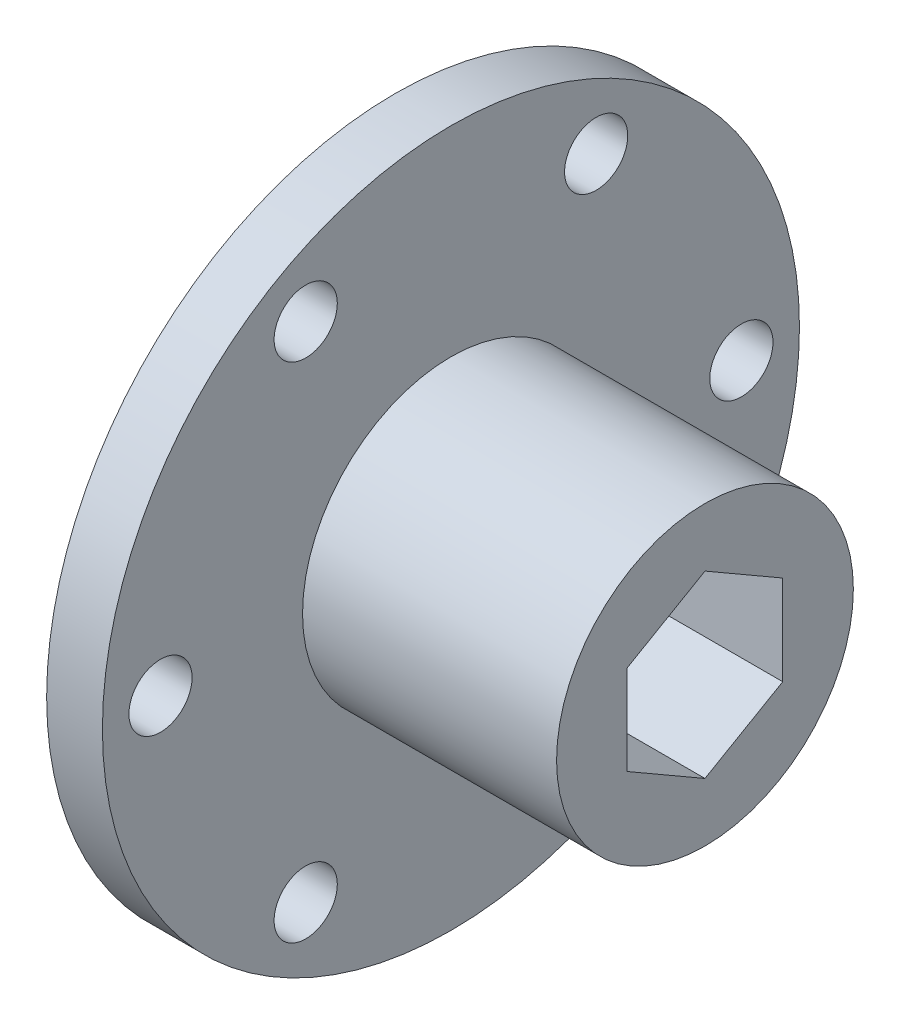
ISO-10303-21;
HEADER;
FILE_DESCRIPTION(('STEP AP214'),'2;1');
FILE_NAME('part.step','',(''),(''),'','','');
FILE_SCHEMA(('AUTOMOTIVE_DESIGN { 1 0 10303 214 1 1 1 1 }'));
ENDSEC;
DATA;
#1=APPLICATION_CONTEXT('core data for automotive mechanical design processes');
#2=APPLICATION_PROTOCOL_DEFINITION('international standard','automotive_design',2000,#1);
#3=PRODUCT_CONTEXT('',#1,'mechanical');
#4=PRODUCT('Part','Part','',(#3));
#5=PRODUCT_RELATED_PRODUCT_CATEGORY('part','',(#4));
#6=PRODUCT_DEFINITION_FORMATION('','',#4);
#7=PRODUCT_DEFINITION_CONTEXT('part definition',#1,'design');
#8=PRODUCT_DEFINITION('design','',#6,#7);
#9=PRODUCT_DEFINITION_SHAPE('','',#8);
#10=(LENGTH_UNIT() NAMED_UNIT(*) SI_UNIT(.MILLI.,.METRE.));
#11=(NAMED_UNIT(*) PLANE_ANGLE_UNIT() SI_UNIT($,.RADIAN.));
#12=(NAMED_UNIT(*) SI_UNIT($,.STERADIAN.) SOLID_ANGLE_UNIT());
#13=UNCERTAINTY_MEASURE_WITH_UNIT(LENGTH_MEASURE(1.E-05),#10,'distance_accuracy_value','');
#14=(GEOMETRIC_REPRESENTATION_CONTEXT(3) GLOBAL_UNCERTAINTY_ASSIGNED_CONTEXT((#13)) GLOBAL_UNIT_ASSIGNED_CONTEXT((#10,
#11,#12)) REPRESENTATION_CONTEXT('',''));
#15=CARTESIAN_POINT('',(0.,0.,0.));
#16=DIRECTION('',(0.,0.,1.));
#17=DIRECTION('',(1.,0.,0.));
#18=AXIS2_PLACEMENT_3D('',#15,#16,#17);
#19=CARTESIAN_POINT('',(-17.6070662460568,0.,0.));
#20=DIRECTION('',(-1.,0.,0.));
#21=DIRECTION('',(0.,0.,1.));
#22=AXIS2_PLACEMENT_3D('',#19,#20,#21);
#23=PLANE('',#22);
#24=CARTESIAN_POINT('',(-17.6070662460568,-20.6222299276169,-11.90625));
#25=DIRECTION('',(1.,0.,0.));
#26=DIRECTION('',(0.,0.,-1.));
#27=AXIS2_PLACEMENT_3D('',#24,#25,#26);
#28=CIRCLE('',#27,2.59080000000001);
#29=CARTESIAN_POINT('',(-17.6070662460568,-20.6222299276169,-14.49705));
#30=VERTEX_POINT('',#29);
#31=EDGE_CURVE('E228',#30,#30,#28,.T.);
#32=ORIENTED_EDGE('',*,*,#31,.T.);
#33=EDGE_LOOP('',(#32));
#34=FACE_BOUND('',#33,.T.);
#35=CARTESIAN_POINT('',(-17.6070662460567,0.,-23.8125));
#36=DIRECTION('',(1.,0.,0.));
#37=DIRECTION('',(0.,0.,-1.));
#38=AXIS2_PLACEMENT_3D('',#35,#36,#37);
#39=CIRCLE('',#38,2.59080000000001);
#40=CARTESIAN_POINT('',(-17.6070662460567,0.,-26.4033));
#41=VERTEX_POINT('',#40);
#42=EDGE_CURVE('E233',#41,#41,#39,.T.);
#43=ORIENTED_EDGE('',*,*,#42,.T.);
#44=EDGE_LOOP('',(#43));
#45=FACE_BOUND('',#44,.T.);
#46=CARTESIAN_POINT('',(-17.6070662460567,20.6222299276169,-11.90625));
#47=DIRECTION('',(1.,0.,0.));
#48=DIRECTION('',(0.,0.,-1.));
#49=AXIS2_PLACEMENT_3D('',#46,#47,#48);
#50=CIRCLE('',#49,2.59080000000001);
#51=CARTESIAN_POINT('',(-17.6070662460567,20.6222299276169,-14.49705));
#52=VERTEX_POINT('',#51);
#53=EDGE_CURVE('E239',#52,#52,#50,.T.);
#54=ORIENTED_EDGE('',*,*,#53,.T.);
#55=EDGE_LOOP('',(#54));
#56=FACE_BOUND('',#55,.T.);
#57=CARTESIAN_POINT('',(-17.6070662460567,20.6222299276169,11.90625));
#58=DIRECTION('',(1.,0.,0.));
#59=DIRECTION('',(0.,0.,-1.));
#60=AXIS2_PLACEMENT_3D('',#57,#58,#59);
#61=CIRCLE('',#60,2.59080000000001);
#62=CARTESIAN_POINT('',(-17.6070662460567,20.6222299276169,9.31544999999998));
#63=VERTEX_POINT('',#62);
#64=EDGE_CURVE('E245',#63,#63,#61,.T.);
#65=ORIENTED_EDGE('',*,*,#64,.T.);
#66=EDGE_LOOP('',(#65));
#67=FACE_BOUND('',#66,.T.);
#68=CARTESIAN_POINT('',(-17.6070662460568,0.,23.8125));
#69=DIRECTION('',(1.,0.,0.));
#70=DIRECTION('',(0.,0.,-1.));
#71=AXIS2_PLACEMENT_3D('',#68,#69,#70);
#72=CIRCLE('',#71,2.59080000000001);
#73=CARTESIAN_POINT('',(-17.6070662460568,0.,21.2217));
#74=VERTEX_POINT('',#73);
#75=EDGE_CURVE('E109',#74,#74,#72,.T.);
#76=ORIENTED_EDGE('',*,*,#75,.T.);
#77=EDGE_LOOP('',(#76));
#78=FACE_BOUND('',#77,.T.);
#79=DIRECTION('',(0.,-0.5,-0.866025403784437));
#80=VECTOR('',#79,1.);
#81=CARTESIAN_POINT('',(-17.6070662460568,-3.68085890619155,6.3754));
#82=LINE('',#81,#80);
#83=CARTESIAN_POINT('',(-17.6070662460568,-3.68085890619155,6.3754));
#84=VERTEX_POINT('',#83);
#85=CARTESIAN_POINT('',(-17.6070662460568,-7.36169781238311,0.));
#86=VERTEX_POINT('',#85);
#87=EDGE_CURVE('E87',#84,#86,#82,.T.);
#88=ORIENTED_EDGE('',*,*,#87,.T.);
#89=DIRECTION('',(0.,0.500000000000001,-0.866025403784438));
#90=VECTOR('',#89,1.);
#91=CARTESIAN_POINT('',(-17.6070662460568,-7.36169781238311,0.));
#92=LINE('',#91,#90);
#93=CARTESIAN_POINT('',(-17.6070662460568,-3.68085890619155,-6.37539999999998));
#94=VERTEX_POINT('',#93);
#95=EDGE_CURVE('E96',#86,#94,#92,.T.);
#96=ORIENTED_EDGE('',*,*,#95,.T.);
#97=DIRECTION('',(0.,0.999999999999999,0.));
#98=VECTOR('',#97,1.);
#99=CARTESIAN_POINT('',(-17.6070662460568,-3.68085890619155,-6.37539999999998));
#100=LINE('',#99,#98);
#101=CARTESIAN_POINT('',(-17.6070662460568,3.68081890619154,-6.3754));
#102=VERTEX_POINT('',#101);
#103=EDGE_CURVE('E47',#94,#102,#100,.T.);
#104=ORIENTED_EDGE('',*,*,#103,.T.);
#105=DIRECTION('',(0.,0.500000000000001,0.866025403784437));
#106=VECTOR('',#105,1.);
#107=CARTESIAN_POINT('',(-17.6070662460568,3.68081890619154,-6.3754));
#108=LINE('',#107,#106);
#109=CARTESIAN_POINT('',(-17.6070662460567,7.36165781238307,0.));
#110=VERTEX_POINT('',#109);
#111=EDGE_CURVE('E113',#102,#110,#108,.T.);
#112=ORIENTED_EDGE('',*,*,#111,.T.);
#113=DIRECTION('',(0.,-0.500000000000001,0.866025403784437));
#114=VECTOR('',#113,1.);
#115=CARTESIAN_POINT('',(-17.6070662460567,7.36165781238307,0.));
#116=LINE('',#115,#114);
#117=CARTESIAN_POINT('',(-17.6070662460568,3.68081890619157,6.37540000000003));
#118=VERTEX_POINT('',#117);
#119=EDGE_CURVE('E116',#110,#118,#116,.T.);
#120=ORIENTED_EDGE('',*,*,#119,.T.);
#121=DIRECTION('',(0.,-0.999999999999999,0.));
#122=VECTOR('',#121,1.);
#123=CARTESIAN_POINT('',(-17.6070662460568,3.68081890619157,6.37540000000003));
#124=LINE('',#123,#122);
#125=EDGE_CURVE('E93',#118,#84,#124,.T.);
#126=ORIENTED_EDGE('',*,*,#125,.T.);
#127=EDGE_LOOP('',(#88,#96,#104,#112,#120,#126));
#128=FACE_BOUND('',#127,.T.);
#129=CARTESIAN_POINT('',(-17.6070662460568,0.,0.));
#130=DIRECTION('',(-1.,0.,0.));
#131=DIRECTION('',(0.,0.,1.));
#132=AXIS2_PLACEMENT_3D('',#129,#130,#131);
#133=CIRCLE('',#132,28.575);
#134=CARTESIAN_POINT('',(-17.6070662460568,0.,28.575));
#135=VERTEX_POINT('',#134);
#136=EDGE_CURVE('E40',#135,#135,#133,.T.);
#137=ORIENTED_EDGE('',*,*,#136,.T.);
#138=EDGE_LOOP('',(#137));
#139=FACE_BOUND('',#138,.T.);
#140=CARTESIAN_POINT('',(-17.6070662460568,-20.622229927617,11.90625));
#141=DIRECTION('',(1.,0.,0.));
#142=DIRECTION('',(0.,0.,-1.));
#143=AXIS2_PLACEMENT_3D('',#140,#141,#142);
#144=CIRCLE('',#143,2.59080000000001);
#145=CARTESIAN_POINT('',(-17.6070662460568,-20.622229927617,9.31544999999998));
#146=VERTEX_POINT('',#145);
#147=EDGE_CURVE('E218',#146,#146,#144,.T.);
#148=ORIENTED_EDGE('',*,*,#147,.T.);
#149=EDGE_LOOP('',(#148));
#150=FACE_BOUND('',#149,.T.);
#151=ADVANCED_FACE('F32',(#34,#45,#56,#67,#78,#128,#139,#150),#23,.T.);
#152=CARTESIAN_POINT('',(-13.0350662460568,28.575,0.));
#153=DIRECTION('',(1.,0.,0.));
#154=DIRECTION('',(0.,0.,-1.));
#155=AXIS2_PLACEMENT_3D('',#152,#153,#154);
#156=PLANE('',#155);
#157=CARTESIAN_POINT('',(-13.0350662460568,-20.622229927617,11.90625));
#158=DIRECTION('',(1.,0.,0.));
#159=DIRECTION('',(0.,0.,-1.));
#160=AXIS2_PLACEMENT_3D('',#157,#158,#159);
#161=CIRCLE('',#160,2.59080000000001);
#162=CARTESIAN_POINT('',(-13.0350662460568,-20.622229927617,9.31544999999998));
#163=VERTEX_POINT('',#162);
#164=EDGE_CURVE('E221',#163,#163,#161,.T.);
#165=ORIENTED_EDGE('',*,*,#164,.F.);
#166=EDGE_LOOP('',(#165));
#167=FACE_BOUND('',#166,.T.);
#168=CARTESIAN_POINT('',(-13.0350662460568,-20.6222299276169,-11.9062500000001));
#169=DIRECTION('',(1.,0.,0.));
#170=DIRECTION('',(0.,0.,-1.));
#171=AXIS2_PLACEMENT_3D('',#168,#169,#170);
#172=CIRCLE('',#171,2.59080000000001);
#173=CARTESIAN_POINT('',(-13.0350662460568,-20.6222299276169,-14.4970500000001));
#174=VERTEX_POINT('',#173);
#175=EDGE_CURVE('E223',#174,#174,#172,.T.);
#176=ORIENTED_EDGE('',*,*,#175,.F.);
#177=EDGE_LOOP('',(#176));
#178=FACE_BOUND('',#177,.T.);
#179=CARTESIAN_POINT('',(-13.0350662460567,0.,-23.8125));
#180=DIRECTION('',(1.,0.,0.));
#181=DIRECTION('',(0.,0.,-1.));
#182=AXIS2_PLACEMENT_3D('',#179,#180,#181);
#183=CIRCLE('',#182,2.59080000000001);
#184=CARTESIAN_POINT('',(-13.0350662460567,0.,-26.4033));
#185=VERTEX_POINT('',#184);
#186=EDGE_CURVE('E230',#185,#185,#183,.T.);
#187=ORIENTED_EDGE('',*,*,#186,.F.);
#188=EDGE_LOOP('',(#187));
#189=FACE_BOUND('',#188,.T.);
#190=CARTESIAN_POINT('',(-13.0350662460568,20.6222299276169,-11.90625));
#191=DIRECTION('',(1.,0.,0.));
#192=DIRECTION('',(0.,0.,-1.));
#193=AXIS2_PLACEMENT_3D('',#190,#191,#192);
#194=CIRCLE('',#193,2.59080000000001);
#195=CARTESIAN_POINT('',(-13.0350662460568,20.6222299276169,-14.49705));
#196=VERTEX_POINT('',#195);
#197=EDGE_CURVE('E236',#196,#196,#194,.T.);
#198=ORIENTED_EDGE('',*,*,#197,.F.);
#199=EDGE_LOOP('',(#198));
#200=FACE_BOUND('',#199,.T.);
#201=CARTESIAN_POINT('',(-13.0350662460567,20.622229927617,11.90625));
#202=DIRECTION('',(1.,0.,0.));
#203=DIRECTION('',(0.,0.,-1.));
#204=AXIS2_PLACEMENT_3D('',#201,#202,#203);
#205=CIRCLE('',#204,2.59080000000001);
#206=CARTESIAN_POINT('',(-13.0350662460567,20.622229927617,9.31545000000001));
#207=VERTEX_POINT('',#206);
#208=EDGE_CURVE('E242',#207,#207,#205,.T.);
#209=ORIENTED_EDGE('',*,*,#208,.F.);
#210=EDGE_LOOP('',(#209));
#211=FACE_BOUND('',#210,.T.);
#212=CARTESIAN_POINT('',(-13.0350662460568,0.,23.8125));
#213=DIRECTION('',(1.,0.,0.));
#214=DIRECTION('',(0.,0.,-1.));
#215=AXIS2_PLACEMENT_3D('',#212,#213,#214);
#216=CIRCLE('',#215,2.59080000000001);
#217=CARTESIAN_POINT('',(-13.0350662460568,0.,21.2217));
#218=VERTEX_POINT('',#217);
#219=EDGE_CURVE('E247',#218,#218,#216,.T.);
#220=ORIENTED_EDGE('',*,*,#219,.F.);
#221=EDGE_LOOP('',(#220));
#222=FACE_BOUND('',#221,.T.);
#223=CARTESIAN_POINT('',(-13.0350662460568,0.,0.));
#224=DIRECTION('',(-1.,0.,0.));
#225=DIRECTION('',(0.,0.,1.));
#226=AXIS2_PLACEMENT_3D('',#223,#224,#225);
#227=CIRCLE('',#226,28.575);
#228=CARTESIAN_POINT('',(-13.0350662460568,0.,28.575));
#229=VERTEX_POINT('',#228);
#230=EDGE_CURVE('E11',#229,#229,#227,.T.);
#231=ORIENTED_EDGE('',*,*,#230,.F.);
#232=EDGE_LOOP('',(#231));
#233=FACE_BOUND('',#232,.T.);
#234=CARTESIAN_POINT('',(-13.0350662460568,0.,0.));
#235=DIRECTION('',(1.,0.,0.));
#236=DIRECTION('',(0.,0.,-1.));
#237=AXIS2_PLACEMENT_3D('',#234,#235,#236);
#238=CIRCLE('',#237,12.1666);
#239=CARTESIAN_POINT('',(-13.0350662460568,0.,-12.1666));
#240=VERTEX_POINT('',#239);
#241=EDGE_CURVE('E132',#240,#240,#238,.T.);
#242=ORIENTED_EDGE('',*,*,#241,.F.);
#243=EDGE_LOOP('',(#242));
#244=FACE_BOUND('',#243,.T.);
#245=ADVANCED_FACE('F150',(#167,#178,#189,#200,#211,#222,#233,#244),#156,.T.);
#246=CARTESIAN_POINT('',(-13.0350662460568,0.,0.));
#247=DIRECTION('',(-1.,0.,0.));
#248=DIRECTION('',(0.,0.,1.));
#249=AXIS2_PLACEMENT_3D('',#246,#247,#248);
#250=CYLINDRICAL_SURFACE('',#249,28.575);
#251=ORIENTED_EDGE('',*,*,#230,.T.);
#252=EDGE_LOOP('',(#251));
#253=FACE_BOUND('',#252,.T.);
#254=ORIENTED_EDGE('',*,*,#136,.F.);
#255=EDGE_LOOP('',(#254));
#256=FACE_BOUND('',#255,.T.);
#257=ADVANCED_FACE('F34',(#253,#256),#250,.T.);
#258=CARTESIAN_POINT('',(7.79293375394323,0.,0.));
#259=DIRECTION('',(-1.,0.,0.));
#260=DIRECTION('',(0.,0.,1.));
#261=AXIS2_PLACEMENT_3D('',#258,#259,#260);
#262=CYLINDRICAL_SURFACE('',#261,12.1666);
#263=CARTESIAN_POINT('',(7.79293375394323,0.,0.));
#264=DIRECTION('',(1.,0.,0.));
#265=DIRECTION('',(0.,0.,-1.));
#266=AXIS2_PLACEMENT_3D('',#263,#264,#265);
#267=CIRCLE('',#266,12.1666);
#268=CARTESIAN_POINT('',(7.79293375394323,0.,-12.1666));
#269=VERTEX_POINT('',#268);
#270=EDGE_CURVE('E140',#269,#269,#267,.T.);
#271=ORIENTED_EDGE('',*,*,#270,.F.);
#272=EDGE_LOOP('',(#271));
#273=FACE_BOUND('',#272,.T.);
#274=ORIENTED_EDGE('',*,*,#241,.T.);
#275=EDGE_LOOP('',(#274));
#276=FACE_BOUND('',#275,.T.);
#277=ADVANCED_FACE('F149',(#273,#276),#262,.T.);
#278=CARTESIAN_POINT('',(7.79293375394323,0.,0.));
#279=DIRECTION('',(1.,0.,0.));
#280=DIRECTION('',(0.,0.,-1.));
#281=AXIS2_PLACEMENT_3D('',#278,#279,#280);
#282=PLANE('',#281);
#283=DIRECTION('',(0.,-0.5,-0.866025403784437));
#284=VECTOR('',#283,1.);
#285=CARTESIAN_POINT('',(7.79293375394323,-3.68085890619144,6.37539999999999));
#286=LINE('',#285,#284);
#287=CARTESIAN_POINT('',(7.79293375394323,-3.68085890619144,6.37539999999999));
#288=VERTEX_POINT('',#287);
#289=CARTESIAN_POINT('',(7.79293375394324,-7.36169781238299,0.));
#290=VERTEX_POINT('',#289);
#291=EDGE_CURVE('E55',#288,#290,#286,.T.);
#292=ORIENTED_EDGE('',*,*,#291,.F.);
#293=DIRECTION('',(0.,-0.999999999999999,0.));
#294=VECTOR('',#293,1.);
#295=CARTESIAN_POINT('',(7.79293375394324,3.68081890619168,6.3754000000001));
#296=LINE('',#295,#294);
#297=CARTESIAN_POINT('',(7.79293375394324,3.68081890619168,6.3754000000001));
#298=VERTEX_POINT('',#297);
#299=EDGE_CURVE('E103',#298,#288,#296,.T.);
#300=ORIENTED_EDGE('',*,*,#299,.F.);
#301=DIRECTION('',(0.,-0.500000000000001,0.866025403784437));
#302=VECTOR('',#301,1.);
#303=CARTESIAN_POINT('',(7.7929337539433,7.3616578123831,0.));
#304=LINE('',#303,#302);
#305=CARTESIAN_POINT('',(7.7929337539433,7.3616578123831,0.));
#306=VERTEX_POINT('',#305);
#307=EDGE_CURVE('E106',#306,#298,#304,.T.);
#308=ORIENTED_EDGE('',*,*,#307,.F.);
#309=DIRECTION('',(0.,0.500000000000001,0.866025403784437));
#310=VECTOR('',#309,1.);
#311=CARTESIAN_POINT('',(7.79293375394323,3.68081890619157,-6.37539999999999));
#312=LINE('',#311,#310);
#313=CARTESIAN_POINT('',(7.79293375394323,3.68081890619157,-6.37539999999999));
#314=VERTEX_POINT('',#313);
#315=EDGE_CURVE('E125',#314,#306,#312,.T.);
#316=ORIENTED_EDGE('',*,*,#315,.F.);
#317=DIRECTION('',(0.,0.999999999999999,0.));
#318=VECTOR('',#317,1.);
#319=CARTESIAN_POINT('',(7.79293375394324,-3.68085890619155,-6.37539999999999));
#320=LINE('',#319,#318);
#321=CARTESIAN_POINT('',(7.79293375394324,-3.68085890619155,-6.37539999999999));
#322=VERTEX_POINT('',#321);
#323=EDGE_CURVE('E122',#322,#314,#320,.T.);
#324=ORIENTED_EDGE('',*,*,#323,.F.);
#325=DIRECTION('',(0.,0.500000000000001,-0.866025403784438));
#326=VECTOR('',#325,1.);
#327=CARTESIAN_POINT('',(7.79293375394324,-7.36169781238299,0.));
#328=LINE('',#327,#326);
#329=EDGE_CURVE('E120',#290,#322,#328,.T.);
#330=ORIENTED_EDGE('',*,*,#329,.F.);
#331=EDGE_LOOP('',(#292,#300,#308,#316,#324,#330));
#332=FACE_BOUND('',#331,.T.);
#333=ORIENTED_EDGE('',*,*,#270,.T.);
#334=EDGE_LOOP('',(#333));
#335=FACE_BOUND('',#334,.T.);
#336=ADVANCED_FACE('F156',(#332,#335),#282,.T.);
#337=CARTESIAN_POINT('',(-17.6070662460568,-3.68085890619155,6.3754));
#338=DIRECTION('',(0.,-0.866025403784437,0.5));
#339=DIRECTION('',(0.,-0.5,-0.866025403784437));
#340=AXIS2_PLACEMENT_3D('',#337,#338,#339);
#341=PLANE('',#340);
#342=ORIENTED_EDGE('',*,*,#291,.T.);
#343=DIRECTION('',(1.,0.,0.));
#344=VECTOR('',#343,1.);
#345=CARTESIAN_POINT('',(-17.6070662460568,-7.36169781238311,0.));
#346=LINE('',#345,#344);
#347=EDGE_CURVE('E83',#86,#290,#346,.T.);
#348=ORIENTED_EDGE('',*,*,#347,.F.);
#349=ORIENTED_EDGE('',*,*,#87,.F.);
#350=DIRECTION('',(1.,0.,0.));
#351=VECTOR('',#350,1.);
#352=CARTESIAN_POINT('',(-17.6070662460568,-3.68085890619155,6.3754));
#353=LINE('',#352,#351);
#354=EDGE_CURVE('E130',#84,#288,#353,.T.);
#355=ORIENTED_EDGE('',*,*,#354,.T.);
#356=EDGE_LOOP('',(#342,#348,#349,#355));
#357=FACE_BOUND('',#356,.T.);
#358=ADVANCED_FACE('F85',(#357),#341,.F.);
#359=CARTESIAN_POINT('',(-17.6070662460568,3.68081890619157,6.37540000000003));
#360=DIRECTION('',(0.,0.,0.999999999999999));
#361=DIRECTION('',(0.,-0.999999999999999,0.));
#362=AXIS2_PLACEMENT_3D('',#359,#360,#361);
#363=PLANE('',#362);
#364=ORIENTED_EDGE('',*,*,#299,.T.);
#365=ORIENTED_EDGE('',*,*,#354,.F.);
#366=ORIENTED_EDGE('',*,*,#125,.F.);
#367=DIRECTION('',(1.,0.,0.));
#368=VECTOR('',#367,1.);
#369=CARTESIAN_POINT('',(-17.6070662460568,3.68081890619157,6.37540000000003));
#370=LINE('',#369,#368);
#371=EDGE_CURVE('E133',#118,#298,#370,.T.);
#372=ORIENTED_EDGE('',*,*,#371,.T.);
#373=EDGE_LOOP('',(#364,#365,#366,#372));
#374=FACE_BOUND('',#373,.T.);
#375=ADVANCED_FACE('F173',(#374),#363,.F.);
#376=CARTESIAN_POINT('',(-17.6070662460567,7.36165781238307,0.));
#377=DIRECTION('',(0.,0.866025403784437,0.500000000000001));
#378=DIRECTION('',(0.,-0.500000000000001,0.866025403784437));
#379=AXIS2_PLACEMENT_3D('',#376,#377,#378);
#380=PLANE('',#379);
#381=ORIENTED_EDGE('',*,*,#307,.T.);
#382=ORIENTED_EDGE('',*,*,#371,.F.);
#383=ORIENTED_EDGE('',*,*,#119,.F.);
#384=DIRECTION('',(1.,0.,0.));
#385=VECTOR('',#384,1.);
#386=CARTESIAN_POINT('',(-17.6070662460567,7.36165781238307,0.));
#387=LINE('',#386,#385);
#388=EDGE_CURVE('E135',#110,#306,#387,.T.);
#389=ORIENTED_EDGE('',*,*,#388,.T.);
#390=EDGE_LOOP('',(#381,#382,#383,#389));
#391=FACE_BOUND('',#390,.T.);
#392=ADVANCED_FACE('F183',(#391),#380,.F.);
#393=CARTESIAN_POINT('',(-17.6070662460568,3.68081890619154,-6.3754));
#394=DIRECTION('',(0.,0.866025403784437,-0.500000000000001));
#395=DIRECTION('',(0.,0.500000000000001,0.866025403784437));
#396=AXIS2_PLACEMENT_3D('',#393,#394,#395);
#397=PLANE('',#396);
#398=ORIENTED_EDGE('',*,*,#315,.T.);
#399=ORIENTED_EDGE('',*,*,#388,.F.);
#400=ORIENTED_EDGE('',*,*,#111,.F.);
#401=DIRECTION('',(1.,0.,0.));
#402=VECTOR('',#401,1.);
#403=CARTESIAN_POINT('',(-17.6070662460568,3.68081890619154,-6.3754));
#404=LINE('',#403,#402);
#405=EDGE_CURVE('E137',#102,#314,#404,.T.);
#406=ORIENTED_EDGE('',*,*,#405,.T.);
#407=EDGE_LOOP('',(#398,#399,#400,#406));
#408=FACE_BOUND('',#407,.T.);
#409=ADVANCED_FACE('F180',(#408),#397,.F.);
#410=CARTESIAN_POINT('',(-17.6070662460568,-3.68085890619155,-6.37539999999998));
#411=DIRECTION('',(0.,0.,-0.999999999999999));
#412=DIRECTION('',(0.,0.999999999999999,0.));
#413=AXIS2_PLACEMENT_3D('',#410,#411,#412);
#414=PLANE('',#413);
#415=ORIENTED_EDGE('',*,*,#323,.T.);
#416=ORIENTED_EDGE('',*,*,#405,.F.);
#417=ORIENTED_EDGE('',*,*,#103,.F.);
#418=DIRECTION('',(1.,0.,0.));
#419=VECTOR('',#418,1.);
#420=CARTESIAN_POINT('',(-17.6070662460568,-3.68085890619155,-6.37539999999998));
#421=LINE('',#420,#419);
#422=EDGE_CURVE('E92',#94,#322,#421,.T.);
#423=ORIENTED_EDGE('',*,*,#422,.T.);
#424=EDGE_LOOP('',(#415,#416,#417,#423));
#425=FACE_BOUND('',#424,.T.);
#426=ADVANCED_FACE('F177',(#425),#414,.F.);
#427=CARTESIAN_POINT('',(-17.6070662460568,-7.36169781238311,0.));
#428=DIRECTION('',(0.,-0.866025403784438,-0.500000000000001));
#429=DIRECTION('',(0.,0.500000000000001,-0.866025403784438));
#430=AXIS2_PLACEMENT_3D('',#427,#428,#429);
#431=PLANE('',#430);
#432=ORIENTED_EDGE('',*,*,#329,.T.);
#433=ORIENTED_EDGE('',*,*,#422,.F.);
#434=ORIENTED_EDGE('',*,*,#95,.F.);
#435=ORIENTED_EDGE('',*,*,#347,.T.);
#436=EDGE_LOOP('',(#432,#433,#434,#435));
#437=FACE_BOUND('',#436,.T.);
#438=ADVANCED_FACE('F97',(#437),#431,.F.);
#439=CARTESIAN_POINT('',(-13.0350662460568,0.,23.8125));
#440=DIRECTION('',(1.,0.,0.));
#441=DIRECTION('',(0.,0.,-1.));
#442=AXIS2_PLACEMENT_3D('',#439,#440,#441);
#443=CYLINDRICAL_SURFACE('',#442,2.59080000000001);
#444=ORIENTED_EDGE('',*,*,#75,.F.);
#445=EDGE_LOOP('',(#444));
#446=FACE_BOUND('',#445,.T.);
#447=ORIENTED_EDGE('',*,*,#219,.T.);
#448=EDGE_LOOP('',(#447));
#449=FACE_BOUND('',#448,.T.);
#450=ADVANCED_FACE('F176',(#446,#449),#443,.F.);
#451=CARTESIAN_POINT('',(-13.0350662460567,20.622229927617,11.90625));
#452=DIRECTION('',(1.,0.,0.));
#453=DIRECTION('',(0.,0.,-1.));
#454=AXIS2_PLACEMENT_3D('',#451,#452,#453);
#455=CYLINDRICAL_SURFACE('',#454,2.59080000000001);
#456=ORIENTED_EDGE('',*,*,#64,.F.);
#457=EDGE_LOOP('',(#456));
#458=FACE_BOUND('',#457,.T.);
#459=ORIENTED_EDGE('',*,*,#208,.T.);
#460=EDGE_LOOP('',(#459));
#461=FACE_BOUND('',#460,.T.);
#462=ADVANCED_FACE('F193',(#458,#461),#455,.F.);
#463=CARTESIAN_POINT('',(-13.0350662460568,20.6222299276169,-11.90625));
#464=DIRECTION('',(1.,0.,0.));
#465=DIRECTION('',(0.,0.,-1.));
#466=AXIS2_PLACEMENT_3D('',#463,#464,#465);
#467=CYLINDRICAL_SURFACE('',#466,2.59080000000001);
#468=ORIENTED_EDGE('',*,*,#53,.F.);
#469=EDGE_LOOP('',(#468));
#470=FACE_BOUND('',#469,.T.);
#471=ORIENTED_EDGE('',*,*,#197,.T.);
#472=EDGE_LOOP('',(#471));
#473=FACE_BOUND('',#472,.T.);
#474=ADVANCED_FACE('F197',(#470,#473),#467,.F.);
#475=CARTESIAN_POINT('',(-13.0350662460567,0.,-23.8125));
#476=DIRECTION('',(1.,0.,0.));
#477=DIRECTION('',(0.,0.,-1.));
#478=AXIS2_PLACEMENT_3D('',#475,#476,#477);
#479=CYLINDRICAL_SURFACE('',#478,2.59080000000001);
#480=ORIENTED_EDGE('',*,*,#42,.F.);
#481=EDGE_LOOP('',(#480));
#482=FACE_BOUND('',#481,.T.);
#483=ORIENTED_EDGE('',*,*,#186,.T.);
#484=EDGE_LOOP('',(#483));
#485=FACE_BOUND('',#484,.T.);
#486=ADVANCED_FACE('F201',(#482,#485),#479,.F.);
#487=CARTESIAN_POINT('',(-13.0350662460568,-20.6222299276169,-11.9062500000001));
#488=DIRECTION('',(1.,0.,0.));
#489=DIRECTION('',(0.,0.,-1.));
#490=AXIS2_PLACEMENT_3D('',#487,#488,#489);
#491=CYLINDRICAL_SURFACE('',#490,2.59080000000001);
#492=ORIENTED_EDGE('',*,*,#31,.F.);
#493=EDGE_LOOP('',(#492));
#494=FACE_BOUND('',#493,.T.);
#495=ORIENTED_EDGE('',*,*,#175,.T.);
#496=EDGE_LOOP('',(#495));
#497=FACE_BOUND('',#496,.T.);
#498=ADVANCED_FACE('F205',(#494,#497),#491,.F.);
#499=CARTESIAN_POINT('',(-13.0350662460568,-20.622229927617,11.90625));
#500=DIRECTION('',(1.,0.,0.));
#501=DIRECTION('',(0.,0.,-1.));
#502=AXIS2_PLACEMENT_3D('',#499,#500,#501);
#503=CYLINDRICAL_SURFACE('',#502,2.59080000000001);
#504=ORIENTED_EDGE('',*,*,#147,.F.);
#505=EDGE_LOOP('',(#504));
#506=FACE_BOUND('',#505,.T.);
#507=ORIENTED_EDGE('',*,*,#164,.T.);
#508=EDGE_LOOP('',(#507));
#509=FACE_BOUND('',#508,.T.);
#510=ADVANCED_FACE('F209',(#506,#509),#503,.F.);
#511=CLOSED_SHELL('',(#151,#245,#257,#277,#336,#358,#375,#392,#409,#426,#438,#450,#462,#474,
#486,#498,#510));
#512=MANIFOLD_SOLID_BREP('B2',#511);
#513=ADVANCED_BREP_SHAPE_REPRESENTATION('',(#18,#512),#14);
#514=SHAPE_DEFINITION_REPRESENTATION(#9,#513);
ENDSEC;
END-ISO-10303-21;
